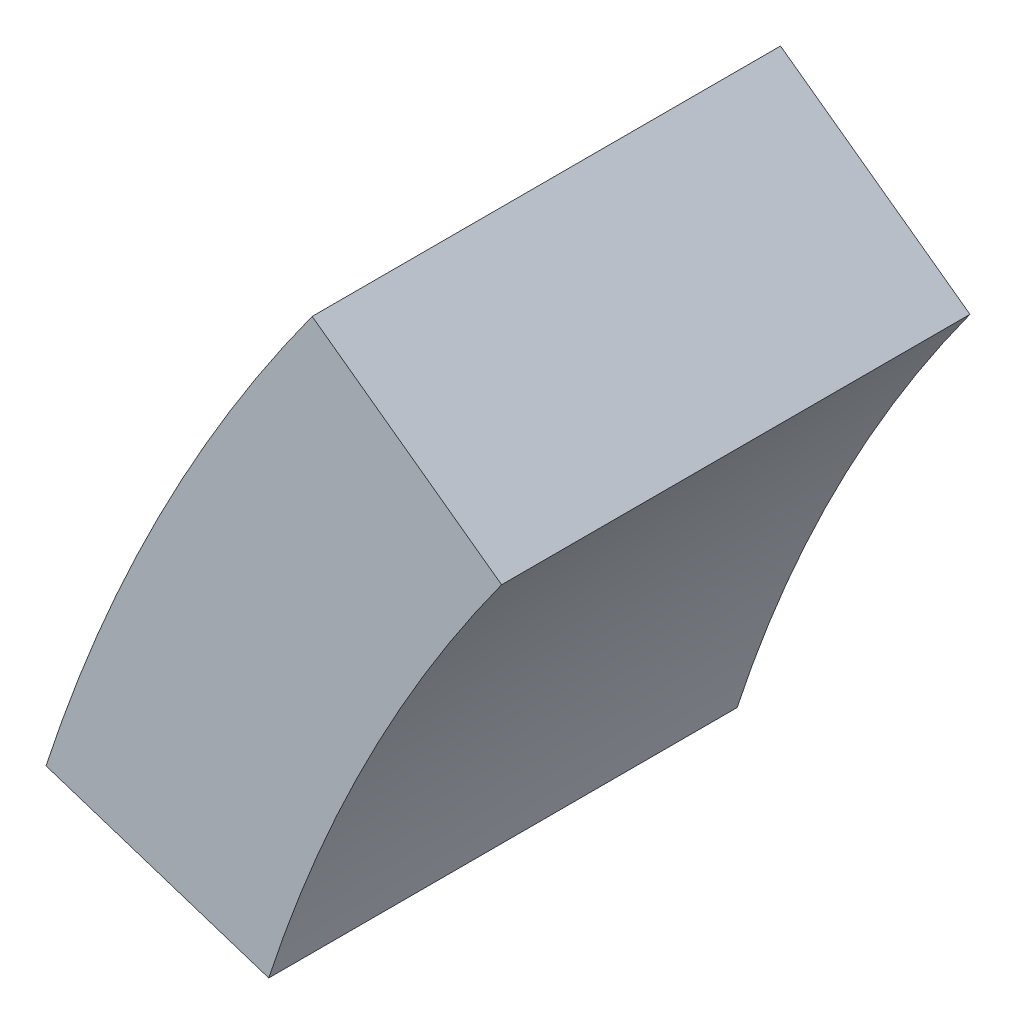
ISO-10303-21;
HEADER;
FILE_DESCRIPTION(('STEP AP214'),'2;1');
FILE_NAME('part.step','',(''),(''),'','','');
FILE_SCHEMA(('AUTOMOTIVE_DESIGN { 1 0 10303 214 1 1 1 1 }'));
ENDSEC;
DATA;
#1=APPLICATION_CONTEXT('core data for automotive mechanical design processes');
#2=APPLICATION_PROTOCOL_DEFINITION('international standard','automotive_design',2000,#1);
#3=PRODUCT_CONTEXT('',#1,'mechanical');
#4=PRODUCT('Part','Part','',(#3));
#5=PRODUCT_RELATED_PRODUCT_CATEGORY('part','',(#4));
#6=PRODUCT_DEFINITION_FORMATION('','',#4);
#7=PRODUCT_DEFINITION_CONTEXT('part definition',#1,'design');
#8=PRODUCT_DEFINITION('design','',#6,#7);
#9=PRODUCT_DEFINITION_SHAPE('','',#8);
#10=(LENGTH_UNIT() NAMED_UNIT(*) SI_UNIT(.MILLI.,.METRE.));
#11=(NAMED_UNIT(*) PLANE_ANGLE_UNIT() SI_UNIT($,.RADIAN.));
#12=(NAMED_UNIT(*) SI_UNIT($,.STERADIAN.) SOLID_ANGLE_UNIT());
#13=UNCERTAINTY_MEASURE_WITH_UNIT(LENGTH_MEASURE(1.E-05),#10,'distance_accuracy_value','');
#14=(GEOMETRIC_REPRESENTATION_CONTEXT(3) GLOBAL_UNCERTAINTY_ASSIGNED_CONTEXT((#13)) GLOBAL_UNIT_ASSIGNED_CONTEXT((#10,
#11,#12)) REPRESENTATION_CONTEXT('',''));
#15=CARTESIAN_POINT('',(0.,0.,0.));
#16=DIRECTION('',(0.,0.,1.));
#17=DIRECTION('',(1.,0.,0.));
#18=AXIS2_PLACEMENT_3D('',#15,#16,#17);
#19=CARTESIAN_POINT('',(-428.79000614256,-590.178812133335,624.));
#20=DIRECTION('',(-0.587785252292478,-0.809016994374944,0.));
#21=DIRECTION('',(0.809016994374944,-0.587785252292478,0.));
#22=AXIS2_PLACEMENT_3D('',#19,#20,#21);
#23=PLANE('',#22);
#24=DIRECTION('',(-0.809016994374944,0.587785252292479,0.));
#25=VECTOR('',#24,1.);
#26=CARTESIAN_POINT('',(-428.79000614256,-590.178812133335,0.));
#27=LINE('',#26,#25);
#28=CARTESIAN_POINT('',(-9878.89311571489,6275.72299100676,0.));
#29=VERTEX_POINT('',#28);
#30=CARTESIAN_POINT('',(-10131.3064179599,6459.11198972201,0.));
#31=VERTEX_POINT('',#30);
#32=EDGE_CURVE('E100',#29,#31,#27,.T.);
#33=ORIENTED_EDGE('',*,*,#32,.T.);
#34=DIRECTION('',(0.,0.,-1.));
#35=VECTOR('',#34,1.);
#36=CARTESIAN_POINT('',(-10131.3064179599,6459.11198972201,624.));
#37=LINE('',#36,#35);
#38=CARTESIAN_POINT('',(-10131.3064179599,6459.11198972201,624.));
#39=VERTEX_POINT('',#38);
#40=EDGE_CURVE('E11',#39,#31,#37,.T.);
#41=ORIENTED_EDGE('',*,*,#40,.F.);
#42=DIRECTION('',(-0.809016994374944,0.587785252292479,0.));
#43=VECTOR('',#42,1.);
#44=CARTESIAN_POINT('',(-428.79000614256,-590.178812133335,624.));
#45=LINE('',#44,#43);
#46=CARTESIAN_POINT('',(-9878.89311571489,6275.72299100676,624.));
#47=VERTEX_POINT('',#46);
#48=EDGE_CURVE('E86',#47,#39,#45,.T.);
#49=ORIENTED_EDGE('',*,*,#48,.F.);
#50=DIRECTION('',(0.,0.,-1.));
#51=VECTOR('',#50,1.);
#52=CARTESIAN_POINT('',(-9878.89311571489,6275.72299100676,624.));
#53=LINE('',#52,#51);
#54=EDGE_CURVE('E53',#47,#29,#53,.T.);
#55=ORIENTED_EDGE('',*,*,#54,.T.);
#56=EDGE_LOOP('',(#33,#41,#49,#55));
#57=FACE_BOUND('',#56,.T.);
#58=ADVANCED_FACE('F37',(#57),#23,.F.);
#59=CARTESIAN_POINT('',(-8112.,4992.,624.));
#60=DIRECTION('',(0.,0.,-1.));
#61=DIRECTION('',(-1.,0.,0.));
#62=AXIS2_PLACEMENT_3D('',#59,#60,#61);
#63=CYLINDRICAL_SURFACE('',#62,2496.);
#64=CARTESIAN_POINT('',(-8112.,4992.,0.));
#65=DIRECTION('',(0.,0.,1.));
#66=DIRECTION('',(1.,0.,0.));
#67=AXIS2_PLACEMENT_3D('',#64,#65,#66);
#68=CIRCLE('',#67,2496.);
#69=CARTESIAN_POINT('',(-10485.8370646727,5763.30641795987,0.));
#70=VERTEX_POINT('',#69);
#71=EDGE_CURVE('E91',#31,#70,#68,.T.);
#72=ORIENTED_EDGE('',*,*,#71,.T.);
#73=DIRECTION('',(0.,0.,-1.));
#74=VECTOR('',#73,1.);
#75=CARTESIAN_POINT('',(-10485.8370646727,5763.30641795987,624.));
#76=LINE('',#75,#74);
#77=CARTESIAN_POINT('',(-10485.8370646727,5763.30641795987,624.));
#78=VERTEX_POINT('',#77);
#79=EDGE_CURVE('E45',#78,#70,#76,.T.);
#80=ORIENTED_EDGE('',*,*,#79,.F.);
#81=CARTESIAN_POINT('',(-8112.,4992.,624.));
#82=DIRECTION('',(0.,0.,1.));
#83=DIRECTION('',(1.,0.,0.));
#84=AXIS2_PLACEMENT_3D('',#81,#82,#83);
#85=CIRCLE('',#84,2496.);
#86=EDGE_CURVE('E78',#39,#78,#85,.T.);
#87=ORIENTED_EDGE('',*,*,#86,.F.);
#88=ORIENTED_EDGE('',*,*,#40,.T.);
#89=EDGE_LOOP('',(#72,#80,#87,#88));
#90=FACE_BOUND('',#89,.T.);
#91=ADVANCED_FACE('F90',(#90),#63,.T.);
#92=CARTESIAN_POINT('',(692.484918906787,2131.24943466149,624.));
#93=DIRECTION('',(-0.309016994374956,-0.951056516295151,0.));
#94=DIRECTION('',(0.951056516295151,-0.309016994374956,0.));
#95=AXIS2_PLACEMENT_3D('',#92,#93,#94);
#96=PLANE('',#95);
#97=DIRECTION('',(-0.951056516295151,0.309016994374956,0.));
#98=VECTOR('',#97,1.);
#99=CARTESIAN_POINT('',(692.484918906787,2131.24943466149,0.));
#100=LINE('',#99,#98);
#101=CARTESIAN_POINT('',(-10189.1074315886,5666.89311571489,0.));
#102=VERTEX_POINT('',#101);
#103=EDGE_CURVE('E103',#102,#70,#100,.T.);
#104=ORIENTED_EDGE('',*,*,#103,.F.);
#105=DIRECTION('',(0.,0.,-1.));
#106=VECTOR('',#105,1.);
#107=CARTESIAN_POINT('',(-10189.1074315886,5666.89311571489,624.));
#108=LINE('',#107,#106);
#109=CARTESIAN_POINT('',(-10189.1074315886,5666.89311571489,624.));
#110=VERTEX_POINT('',#109);
#111=EDGE_CURVE('E67',#110,#102,#108,.T.);
#112=ORIENTED_EDGE('',*,*,#111,.F.);
#113=DIRECTION('',(-0.951056516295151,0.309016994374956,0.));
#114=VECTOR('',#113,1.);
#115=CARTESIAN_POINT('',(692.484918906787,2131.24943466149,624.));
#116=LINE('',#115,#114);
#117=EDGE_CURVE('E85',#110,#78,#116,.T.);
#118=ORIENTED_EDGE('',*,*,#117,.T.);
#119=ORIENTED_EDGE('',*,*,#79,.T.);
#120=EDGE_LOOP('',(#104,#112,#118,#119));
#121=FACE_BOUND('',#120,.T.);
#122=ADVANCED_FACE('F94',(#121),#96,.T.);
#123=CARTESIAN_POINT('',(-8112.,4992.,624.));
#124=DIRECTION('',(0.,0.,-1.));
#125=DIRECTION('',(-1.,0.,0.));
#126=AXIS2_PLACEMENT_3D('',#123,#124,#125);
#127=CYLINDRICAL_SURFACE('',#126,2184.);
#128=CARTESIAN_POINT('',(-8112.,4992.,0.));
#129=DIRECTION('',(0.,0.,1.));
#130=DIRECTION('',(1.,0.,0.));
#131=AXIS2_PLACEMENT_3D('',#128,#129,#130);
#132=CIRCLE('',#131,2184.);
#133=EDGE_CURVE('E105',#29,#102,#132,.T.);
#134=ORIENTED_EDGE('',*,*,#133,.F.);
#135=ORIENTED_EDGE('',*,*,#54,.F.);
#136=CARTESIAN_POINT('',(-8112.,4992.,624.));
#137=DIRECTION('',(0.,0.,1.));
#138=DIRECTION('',(1.,0.,0.));
#139=AXIS2_PLACEMENT_3D('',#136,#137,#138);
#140=CIRCLE('',#139,2184.);
#141=EDGE_CURVE('E95',#47,#110,#140,.T.);
#142=ORIENTED_EDGE('',*,*,#141,.T.);
#143=ORIENTED_EDGE('',*,*,#111,.T.);
#144=EDGE_LOOP('',(#134,#135,#142,#143));
#145=FACE_BOUND('',#144,.T.);
#146=ADVANCED_FACE('F111',(#145),#127,.F.);
#147=CARTESIAN_POINT('',(0.,0.,624.));
#148=DIRECTION('',(0.,0.,1.));
#149=DIRECTION('',(1.,0.,0.));
#150=AXIS2_PLACEMENT_3D('',#147,#148,#149);
#151=PLANE('',#150);
#152=ORIENTED_EDGE('',*,*,#48,.T.);
#153=ORIENTED_EDGE('',*,*,#86,.T.);
#154=ORIENTED_EDGE('',*,*,#117,.F.);
#155=ORIENTED_EDGE('',*,*,#141,.F.);
#156=EDGE_LOOP('',(#152,#153,#154,#155));
#157=FACE_BOUND('',#156,.T.);
#158=ADVANCED_FACE('F82',(#157),#151,.T.);
#159=CARTESIAN_POINT('',(0.,0.,0.));
#160=DIRECTION('',(0.,0.,1.));
#161=DIRECTION('',(1.,0.,0.));
#162=AXIS2_PLACEMENT_3D('',#159,#160,#161);
#163=PLANE('',#162);
#164=ORIENTED_EDGE('',*,*,#32,.F.);
#165=ORIENTED_EDGE('',*,*,#133,.T.);
#166=ORIENTED_EDGE('',*,*,#103,.T.);
#167=ORIENTED_EDGE('',*,*,#71,.F.);
#168=EDGE_LOOP('',(#164,#165,#166,#167));
#169=FACE_BOUND('',#168,.T.);
#170=ADVANCED_FACE('F110',(#169),#163,.F.);
#171=CLOSED_SHELL('',(#58,#91,#122,#146,#158,#170));
#172=MANIFOLD_SOLID_BREP('B2',#171);
#173=ADVANCED_BREP_SHAPE_REPRESENTATION('',(#18,#172),#14);
#174=SHAPE_DEFINITION_REPRESENTATION(#9,#173);
ENDSEC;
END-ISO-10303-21;
